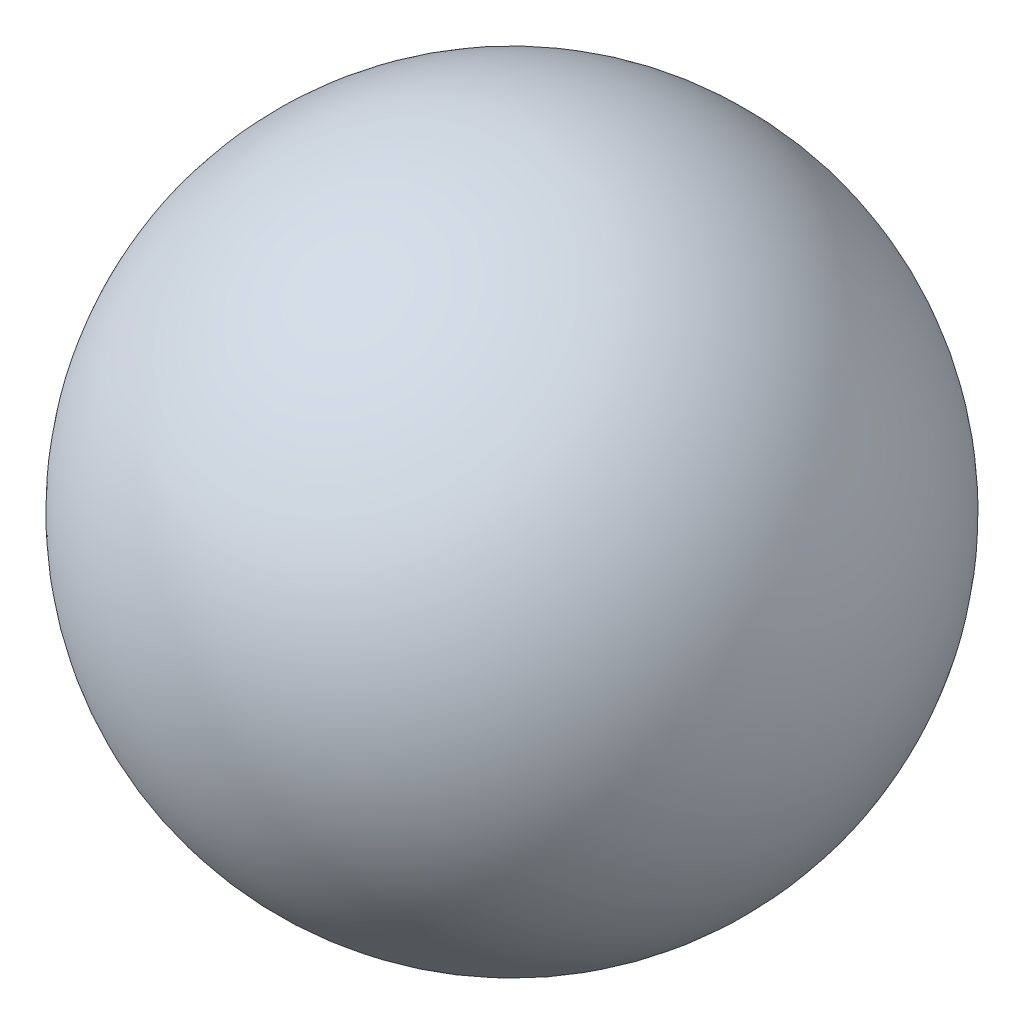
ISO-10303-21;
HEADER;
FILE_DESCRIPTION(('STEP AP214'),'2;1');
FILE_NAME('part.step','',(''),(''),'','','');
FILE_SCHEMA(('AUTOMOTIVE_DESIGN { 1 0 10303 214 1 1 1 1 }'));
ENDSEC;
DATA;
#1=APPLICATION_CONTEXT('core data for automotive mechanical design processes');
#2=APPLICATION_PROTOCOL_DEFINITION('international standard','automotive_design',2000,#1);
#3=PRODUCT_CONTEXT('',#1,'mechanical');
#4=PRODUCT('Part','Part','',(#3));
#5=PRODUCT_RELATED_PRODUCT_CATEGORY('part','',(#4));
#6=PRODUCT_DEFINITION_FORMATION('','',#4);
#7=PRODUCT_DEFINITION_CONTEXT('part definition',#1,'design');
#8=PRODUCT_DEFINITION('design','',#6,#7);
#9=PRODUCT_DEFINITION_SHAPE('','',#8);
#10=(LENGTH_UNIT() NAMED_UNIT(*) SI_UNIT(.MILLI.,.METRE.));
#11=(NAMED_UNIT(*) PLANE_ANGLE_UNIT() SI_UNIT($,.RADIAN.));
#12=(NAMED_UNIT(*) SI_UNIT($,.STERADIAN.) SOLID_ANGLE_UNIT());
#13=UNCERTAINTY_MEASURE_WITH_UNIT(LENGTH_MEASURE(1.E-05),#10,'distance_accuracy_value','');
#14=(GEOMETRIC_REPRESENTATION_CONTEXT(3) GLOBAL_UNCERTAINTY_ASSIGNED_CONTEXT((#13)) GLOBAL_UNIT_ASSIGNED_CONTEXT((#10,
#11,#12)) REPRESENTATION_CONTEXT('',''));
#15=CARTESIAN_POINT('',(0.,0.,0.));
#16=DIRECTION('',(0.,0.,1.));
#17=DIRECTION('',(1.,0.,0.));
#18=AXIS2_PLACEMENT_3D('',#15,#16,#17);
#19=CARTESIAN_POINT('',(0.,0.,0.));
#20=DIRECTION('',(-1.,0.,0.));
#21=DIRECTION('',(0.,1.,0.));
#22=AXIS2_PLACEMENT_3D('',#19,#20,#21);
#23=SPHERICAL_SURFACE('',#22,34.);
#24=CARTESIAN_POINT('',(-34.,0.,0.));
#25=VERTEX_POINT('',#24);
#26=VERTEX_LOOP('',#25);
#27=FACE_BOUND('',#26,.T.);
#28=ADVANCED_FACE('F34',(#27),#23,.T.);
#29=CLOSED_SHELL('',(#28));
#30=CARTESIAN_POINT('',(0.,0.,0.));
#31=DIRECTION('',(-1.,0.,0.));
#32=DIRECTION('',(0.,-1.,0.));
#33=AXIS2_PLACEMENT_3D('',#30,#31,#32);
#34=SPHERICAL_SURFACE('',#33,32.5);
#35=CARTESIAN_POINT('',(-32.5,0.,0.));
#36=VERTEX_POINT('',#35);
#37=VERTEX_LOOP('',#36);
#38=FACE_BOUND('',#37,.T.);
#39=ADVANCED_FACE('F47',(#38),#34,.F.);
#40=CLOSED_SHELL('',(#39));
#41=ORIENTED_CLOSED_SHELL('',*,#40,.T.);
#42=BREP_WITH_VOIDS('B2',#29,(#41));
#43=ADVANCED_BREP_SHAPE_REPRESENTATION('',(#18,#42),#14);
#44=SHAPE_DEFINITION_REPRESENTATION(#9,#43);
ENDSEC;
END-ISO-10303-21;
